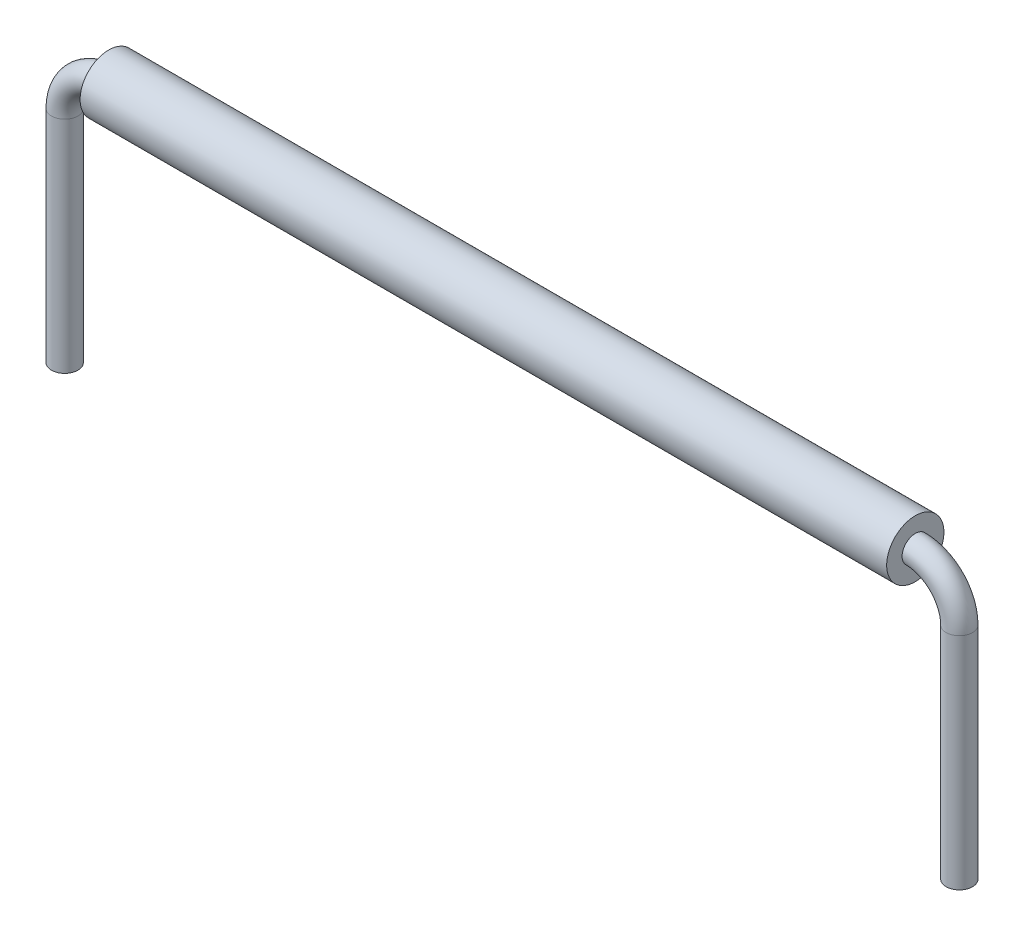
ISO-10303-21;
HEADER;
FILE_DESCRIPTION(('STEP AP214'),'2;1');
FILE_NAME('part.step','',(''),(''),'','','');
FILE_SCHEMA(('AUTOMOTIVE_DESIGN { 1 0 10303 214 1 1 1 1 }'));
ENDSEC;
DATA;
#1=APPLICATION_CONTEXT('core data for automotive mechanical design processes');
#2=APPLICATION_PROTOCOL_DEFINITION('international standard','automotive_design',2000,#1);
#3=PRODUCT_CONTEXT('',#1,'mechanical');
#4=PRODUCT('Part','Part','',(#3));
#5=PRODUCT_RELATED_PRODUCT_CATEGORY('part','',(#4));
#6=PRODUCT_DEFINITION_FORMATION('','',#4);
#7=PRODUCT_DEFINITION_CONTEXT('part definition',#1,'design');
#8=PRODUCT_DEFINITION('design','',#6,#7);
#9=PRODUCT_DEFINITION_SHAPE('','',#8);
#10=(LENGTH_UNIT() NAMED_UNIT(*) SI_UNIT(.MILLI.,.METRE.));
#11=(NAMED_UNIT(*) PLANE_ANGLE_UNIT() SI_UNIT($,.RADIAN.));
#12=(NAMED_UNIT(*) SI_UNIT($,.STERADIAN.) SOLID_ANGLE_UNIT());
#13=UNCERTAINTY_MEASURE_WITH_UNIT(LENGTH_MEASURE(1.E-05),#10,'distance_accuracy_value','');
#14=(GEOMETRIC_REPRESENTATION_CONTEXT(3) GLOBAL_UNCERTAINTY_ASSIGNED_CONTEXT((#13)) GLOBAL_UNIT_ASSIGNED_CONTEXT((#10,
#11,#12)) REPRESENTATION_CONTEXT('',''));
#15=CARTESIAN_POINT('',(0.,0.,0.));
#16=DIRECTION('',(0.,0.,1.));
#17=DIRECTION('',(1.,0.,0.));
#18=AXIS2_PLACEMENT_3D('',#15,#16,#17);
#19=CARTESIAN_POINT('',(9.16,0.,0.));
#20=DIRECTION('',(1.,0.,0.));
#21=DIRECTION('',(0.,0.,-1.));
#22=AXIS2_PLACEMENT_3D('',#19,#20,#21);
#23=PLANE('',#22);
#24=CARTESIAN_POINT('',(9.16,0.,0.));
#25=DIRECTION('',(1.,0.,0.));
#26=DIRECTION('',(0.,0.,-1.));
#27=AXIS2_PLACEMENT_3D('',#24,#25,#26);
#28=CIRCLE('',#27,0.65);
#29=CARTESIAN_POINT('',(9.16,0.,-0.65));
#30=VERTEX_POINT('',#29);
#31=EDGE_CURVE('E11',#30,#30,#28,.T.);
#32=ORIENTED_EDGE('',*,*,#31,.T.);
#33=EDGE_LOOP('',(#32));
#34=FACE_BOUND('',#33,.T.);
#35=CARTESIAN_POINT('',(9.16,0.,0.));
#36=DIRECTION('',(1.,0.,0.));
#37=DIRECTION('',(0.,0.,-1.));
#38=AXIS2_PLACEMENT_3D('',#35,#36,#37);
#39=CIRCLE('',#38,0.3);
#40=CARTESIAN_POINT('',(9.16,0.,-0.3));
#41=VERTEX_POINT('',#40);
#42=EDGE_CURVE('E52',#41,#41,#39,.T.);
#43=ORIENTED_EDGE('',*,*,#42,.F.);
#44=EDGE_LOOP('',(#43));
#45=FACE_BOUND('',#44,.T.);
#46=ADVANCED_FACE('F45',(#34,#45),#23,.T.);
#47=CARTESIAN_POINT('',(9.16,0.,0.));
#48=DIRECTION('',(-1.,0.,0.));
#49=DIRECTION('',(0.,0.,1.));
#50=AXIS2_PLACEMENT_3D('',#47,#48,#49);
#51=CYLINDRICAL_SURFACE('',#50,0.65);
#52=ORIENTED_EDGE('',*,*,#31,.F.);
#53=EDGE_LOOP('',(#52));
#54=FACE_BOUND('',#53,.T.);
#55=CARTESIAN_POINT('',(-9.16,0.,0.));
#56=DIRECTION('',(1.,0.,0.));
#57=DIRECTION('',(0.,0.,-1.));
#58=AXIS2_PLACEMENT_3D('',#55,#56,#57);
#59=CIRCLE('',#58,0.65);
#60=CARTESIAN_POINT('',(-9.16,0.,-0.65));
#61=VERTEX_POINT('',#60);
#62=EDGE_CURVE('E56',#61,#61,#59,.T.);
#63=ORIENTED_EDGE('',*,*,#62,.T.);
#64=EDGE_LOOP('',(#63));
#65=FACE_BOUND('',#64,.T.);
#66=ADVANCED_FACE('F47',(#54,#65),#51,.T.);
#67=CARTESIAN_POINT('',(9.16,0.,0.));
#68=DIRECTION('',(-1.,0.,0.));
#69=DIRECTION('',(0.,0.,1.));
#70=AXIS2_PLACEMENT_3D('',#67,#68,#69);
#71=CYLINDRICAL_SURFACE('',#70,0.3);
#72=ORIENTED_EDGE('',*,*,#42,.T.);
#73=EDGE_LOOP('',(#72));
#74=FACE_BOUND('',#73,.T.);
#75=CARTESIAN_POINT('',(-9.16,0.,0.));
#76=DIRECTION('',(1.,0.,0.));
#77=DIRECTION('',(0.,0.,-1.));
#78=AXIS2_PLACEMENT_3D('',#75,#76,#77);
#79=CIRCLE('',#78,0.3);
#80=CARTESIAN_POINT('',(-9.16,0.,-0.3));
#81=VERTEX_POINT('',#80);
#82=EDGE_CURVE('E60',#81,#81,#79,.T.);
#83=ORIENTED_EDGE('',*,*,#82,.F.);
#84=EDGE_LOOP('',(#83));
#85=FACE_BOUND('',#84,.T.);
#86=ADVANCED_FACE('F69',(#74,#85),#71,.F.);
#87=CARTESIAN_POINT('',(-9.16,0.,0.));
#88=DIRECTION('',(1.,0.,0.));
#89=DIRECTION('',(0.,0.,-1.));
#90=AXIS2_PLACEMENT_3D('',#87,#88,#89);
#91=PLANE('',#90);
#92=ORIENTED_EDGE('',*,*,#82,.T.);
#93=EDGE_LOOP('',(#92));
#94=FACE_BOUND('',#93,.T.);
#95=ORIENTED_EDGE('',*,*,#62,.F.);
#96=EDGE_LOOP('',(#95));
#97=FACE_BOUND('',#96,.T.);
#98=ADVANCED_FACE('F66',(#94,#97),#91,.F.);
#99=CLOSED_SHELL('',(#46,#66,#86,#98));
#100=MANIFOLD_SOLID_BREP('B2',#99);
#101=CARTESIAN_POINT('',(10.16,-6.,0.));
#102=DIRECTION('',(0.,-1.,0.));
#103=DIRECTION('',(0.,0.,-1.));
#104=AXIS2_PLACEMENT_3D('',#101,#102,#103);
#105=PLANE('',#104);
#106=CARTESIAN_POINT('',(10.16,-6.,0.));
#107=DIRECTION('',(0.,-1.,0.));
#108=DIRECTION('',(0.,0.,-1.));
#109=AXIS2_PLACEMENT_3D('',#106,#107,#108);
#110=CIRCLE('',#109,0.3);
#111=CARTESIAN_POINT('',(10.16,-6.,-0.3));
#112=VERTEX_POINT('',#111);
#113=EDGE_CURVE('E129',#112,#112,#110,.T.);
#114=ORIENTED_EDGE('',*,*,#113,.T.);
#115=EDGE_LOOP('',(#114));
#116=FACE_BOUND('',#115,.T.);
#117=ADVANCED_FACE('F107',(#116),#105,.T.);
#118=CARTESIAN_POINT('',(-10.16,-6.,0.));
#119=DIRECTION('',(0.,1.,0.));
#120=DIRECTION('',(0.,0.,-1.));
#121=AXIS2_PLACEMENT_3D('',#118,#119,#120);
#122=PLANE('',#121);
#123=CARTESIAN_POINT('',(-10.16,-6.,0.));
#124=DIRECTION('',(0.,1.,0.));
#125=DIRECTION('',(0.,0.,-1.));
#126=AXIS2_PLACEMENT_3D('',#123,#124,#125);
#127=CIRCLE('',#126,0.3);
#128=CARTESIAN_POINT('',(-10.16,-6.,-0.3));
#129=VERTEX_POINT('',#128);
#130=EDGE_CURVE('E44',#129,#129,#127,.T.);
#131=ORIENTED_EDGE('',*,*,#130,.F.);
#132=EDGE_LOOP('',(#131));
#133=FACE_BOUND('',#132,.T.);
#134=ADVANCED_FACE('F137',(#133),#122,.F.);
#135=CARTESIAN_POINT('',(10.16,-6.,0.));
#136=DIRECTION('',(0.,1.,0.));
#137=DIRECTION('',(0.,0.,1.));
#138=AXIS2_PLACEMENT_3D('',#135,#136,#137);
#139=CYLINDRICAL_SURFACE('',#138,0.3);
#140=CARTESIAN_POINT('',(10.16,-0.999999999999998,0.));
#141=DIRECTION('',(0.,-1.,0.));
#142=DIRECTION('',(0.,0.,-1.));
#143=AXIS2_PLACEMENT_3D('',#140,#141,#142);
#144=CIRCLE('',#143,0.3);
#145=CARTESIAN_POINT('',(10.46,-0.999999999999998,0.));
#146=VERTEX_POINT('',#145);
#147=EDGE_CURVE('E126',#146,#146,#144,.T.);
#148=ORIENTED_EDGE('',*,*,#147,.T.);
#149=EDGE_LOOP('',(#148));
#150=FACE_BOUND('',#149,.T.);
#151=ORIENTED_EDGE('',*,*,#113,.F.);
#152=EDGE_LOOP('',(#151));
#153=FACE_BOUND('',#152,.T.);
#154=ADVANCED_FACE('F134',(#150,#153),#139,.T.);
#155=CARTESIAN_POINT('',(9.16,-0.999999999999998,0.));
#156=DIRECTION('',(0.,0.,1.));
#157=DIRECTION('',(1.,0.,0.));
#158=AXIS2_PLACEMENT_3D('',#155,#156,#157);
#159=TOROIDAL_SURFACE('',#158,0.999999999999997,0.3);
#160=CARTESIAN_POINT('',(9.16,0.,0.));
#161=DIRECTION('',(1.,0.,0.));
#162=DIRECTION('',(0.,0.,-1.));
#163=AXIS2_PLACEMENT_3D('',#160,#161,#162);
#164=CIRCLE('',#163,0.3);
#165=CARTESIAN_POINT('',(9.16,0.299999999999999,0.));
#166=VERTEX_POINT('',#165);
#167=EDGE_CURVE('E121',#166,#166,#164,.T.);
#168=CARTESIAN_POINT('',(9.16,-0.999999999999998,0.));
#169=DIRECTION('',(0.,0.,1.));
#170=DIRECTION('',(1.,0.,0.));
#171=AXIS2_PLACEMENT_3D('',#168,#169,#170);
#172=CIRCLE('',#171,1.3);
#173=EDGE_CURVE('',#146,#166,#172,.T.);
#174=ORIENTED_EDGE('',*,*,#147,.F.);
#175=ORIENTED_EDGE('',*,*,#167,.T.);
#176=ORIENTED_EDGE('',*,*,#173,.T.);
#177=ORIENTED_EDGE('',*,*,#173,.F.);
#178=EDGE_LOOP('',(#174,#176,#175,#177));
#179=FACE_BOUND('',#178,.T.);
#180=ADVANCED_FACE('F136',(#179),#159,.T.);
#181=CARTESIAN_POINT('',(9.16,0.,0.));
#182=DIRECTION('',(-1.,0.,0.));
#183=DIRECTION('',(0.,-1.,0.));
#184=AXIS2_PLACEMENT_3D('',#181,#182,#183);
#185=CYLINDRICAL_SURFACE('',#184,0.3);
#186=CARTESIAN_POINT('',(-9.16,0.,0.));
#187=DIRECTION('',(1.,0.,0.));
#188=DIRECTION('',(0.,0.,-1.));
#189=AXIS2_PLACEMENT_3D('',#186,#187,#188);
#190=CIRCLE('',#189,0.3);
#191=CARTESIAN_POINT('',(-9.16,0.299999999999998,0.));
#192=VERTEX_POINT('',#191);
#193=EDGE_CURVE('E117',#192,#192,#190,.T.);
#194=ORIENTED_EDGE('',*,*,#193,.T.);
#195=EDGE_LOOP('',(#194));
#196=FACE_BOUND('',#195,.T.);
#197=ORIENTED_EDGE('',*,*,#167,.F.);
#198=EDGE_LOOP('',(#197));
#199=FACE_BOUND('',#198,.T.);
#200=ADVANCED_FACE('F144',(#196,#199),#185,.T.);
#201=CARTESIAN_POINT('',(-9.16,-1.,0.));
#202=DIRECTION('',(0.,0.,1.));
#203=DIRECTION('',(1.,0.,0.));
#204=AXIS2_PLACEMENT_3D('',#201,#202,#203);
#205=TOROIDAL_SURFACE('',#204,0.999999999999999,0.3);
#206=CARTESIAN_POINT('',(-10.16,-1.,0.));
#207=DIRECTION('',(0.,1.,0.));
#208=DIRECTION('',(0.,0.,-1.));
#209=AXIS2_PLACEMENT_3D('',#206,#207,#208);
#210=CIRCLE('',#209,0.3);
#211=CARTESIAN_POINT('',(-10.46,-1.,0.));
#212=VERTEX_POINT('',#211);
#213=EDGE_CURVE('E113',#212,#212,#210,.T.);
#214=CARTESIAN_POINT('',(-9.16,-1.,0.));
#215=DIRECTION('',(0.,0.,1.));
#216=DIRECTION('',(1.,0.,0.));
#217=AXIS2_PLACEMENT_3D('',#214,#215,#216);
#218=CIRCLE('',#217,1.3);
#219=EDGE_CURVE('',#192,#212,#218,.T.);
#220=ORIENTED_EDGE('',*,*,#193,.F.);
#221=ORIENTED_EDGE('',*,*,#213,.T.);
#222=ORIENTED_EDGE('',*,*,#219,.T.);
#223=ORIENTED_EDGE('',*,*,#219,.F.);
#224=EDGE_LOOP('',(#220,#222,#221,#223));
#225=FACE_BOUND('',#224,.T.);
#226=ADVANCED_FACE('F150',(#225),#205,.T.);
#227=CARTESIAN_POINT('',(-10.16,-1.,0.));
#228=DIRECTION('',(0.,-1.,0.));
#229=DIRECTION('',(0.,0.,-1.));
#230=AXIS2_PLACEMENT_3D('',#227,#228,#229);
#231=CYLINDRICAL_SURFACE('',#230,0.3);
#232=ORIENTED_EDGE('',*,*,#130,.T.);
#233=EDGE_LOOP('',(#232));
#234=FACE_BOUND('',#233,.T.);
#235=ORIENTED_EDGE('',*,*,#213,.F.);
#236=EDGE_LOOP('',(#235));
#237=FACE_BOUND('',#236,.T.);
#238=ADVANCED_FACE('F148',(#234,#237),#231,.T.);
#239=CLOSED_SHELL('',(#117,#134,#154,#180,#200,#226,#238));
#240=MANIFOLD_SOLID_BREP('B6',#239);
#241=ADVANCED_BREP_SHAPE_REPRESENTATION('',(#18,#100,#240),#14);
#242=SHAPE_DEFINITION_REPRESENTATION(#9,#241);
ENDSEC;
END-ISO-10303-21;
